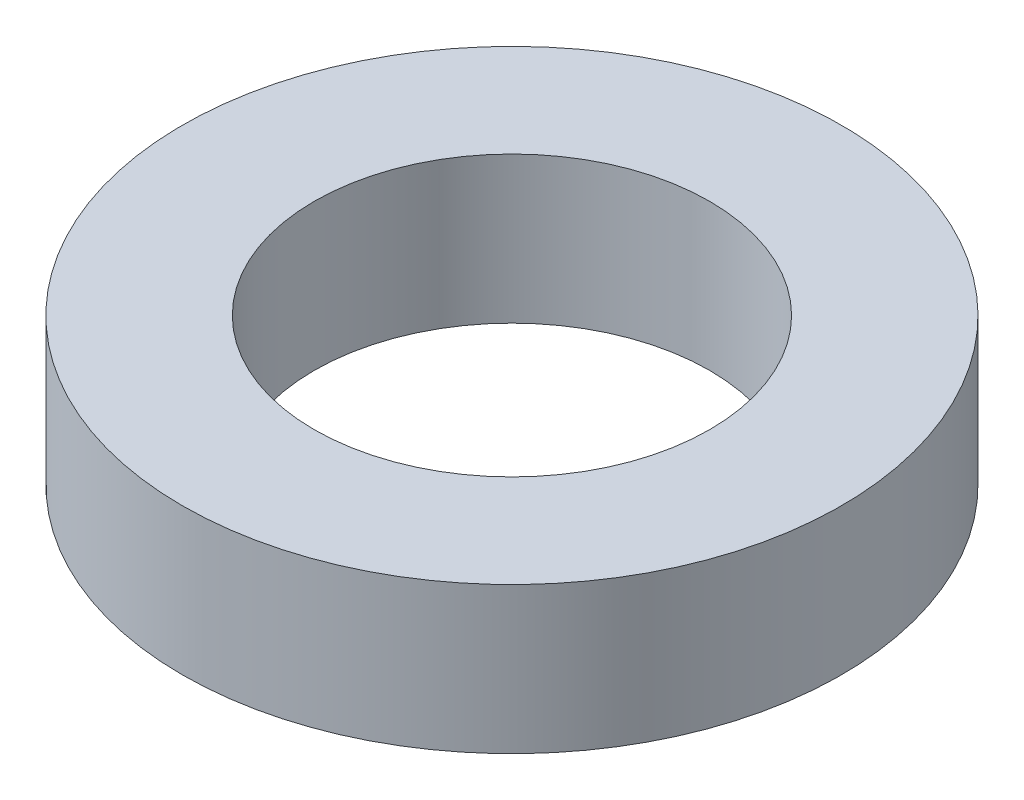
ISO-10303-21;
HEADER;
FILE_DESCRIPTION(('STEP AP214'),'2;1');
FILE_NAME('part.step','',(''),(''),'','','');
FILE_SCHEMA(('AUTOMOTIVE_DESIGN { 1 0 10303 214 1 1 1 1 }'));
ENDSEC;
DATA;
#1=APPLICATION_CONTEXT('core data for automotive mechanical design processes');
#2=APPLICATION_PROTOCOL_DEFINITION('international standard','automotive_design',2000,#1);
#3=PRODUCT_CONTEXT('',#1,'mechanical');
#4=PRODUCT('Part','Part','',(#3));
#5=PRODUCT_RELATED_PRODUCT_CATEGORY('part','',(#4));
#6=PRODUCT_DEFINITION_FORMATION('','',#4);
#7=PRODUCT_DEFINITION_CONTEXT('part definition',#1,'design');
#8=PRODUCT_DEFINITION('design','',#6,#7);
#9=PRODUCT_DEFINITION_SHAPE('','',#8);
#10=(LENGTH_UNIT() NAMED_UNIT(*) SI_UNIT(.MILLI.,.METRE.));
#11=(NAMED_UNIT(*) PLANE_ANGLE_UNIT() SI_UNIT($,.RADIAN.));
#12=(NAMED_UNIT(*) SI_UNIT($,.STERADIAN.) SOLID_ANGLE_UNIT());
#13=UNCERTAINTY_MEASURE_WITH_UNIT(LENGTH_MEASURE(1.E-05),#10,'distance_accuracy_value','');
#14=(GEOMETRIC_REPRESENTATION_CONTEXT(3) GLOBAL_UNCERTAINTY_ASSIGNED_CONTEXT((#13)) GLOBAL_UNIT_ASSIGNED_CONTEXT((#10,
#11,#12)) REPRESENTATION_CONTEXT('',''));
#15=CARTESIAN_POINT('',(0.,0.,0.));
#16=DIRECTION('',(0.,0.,1.));
#17=DIRECTION('',(1.,0.,0.));
#18=AXIS2_PLACEMENT_3D('',#15,#16,#17);
#19=CARTESIAN_POINT('',(0.,1.,0.));
#20=DIRECTION('',(0.,1.,0.));
#21=DIRECTION('',(0.,0.,1.));
#22=AXIS2_PLACEMENT_3D('',#19,#20,#21);
#23=PLANE('',#22);
#24=CARTESIAN_POINT('',(0.,1.,0.));
#25=DIRECTION('',(0.,1.,0.));
#26=DIRECTION('',(0.,0.,1.));
#27=AXIS2_PLACEMENT_3D('',#24,#25,#26);
#28=CIRCLE('',#27,4.5);
#29=CARTESIAN_POINT('',(0.,1.,4.5));
#30=VERTEX_POINT('',#29);
#31=EDGE_CURVE('E10',#30,#30,#28,.T.);
#32=ORIENTED_EDGE('',*,*,#31,.T.);
#33=EDGE_LOOP('',(#32));
#34=FACE_BOUND('',#33,.T.);
#35=CARTESIAN_POINT('',(0.,1.,0.));
#36=DIRECTION('',(0.,1.,0.));
#37=DIRECTION('',(0.,0.,1.));
#38=AXIS2_PLACEMENT_3D('',#35,#36,#37);
#39=CIRCLE('',#38,2.7);
#40=CARTESIAN_POINT('',(0.,1.,2.7));
#41=VERTEX_POINT('',#40);
#42=EDGE_CURVE('E47',#41,#41,#39,.T.);
#43=ORIENTED_EDGE('',*,*,#42,.F.);
#44=EDGE_LOOP('',(#43));
#45=FACE_BOUND('',#44,.T.);
#46=ADVANCED_FACE('F36',(#34,#45),#23,.T.);
#47=CARTESIAN_POINT('',(0.,-1.,0.));
#48=DIRECTION('',(0.,1.,0.));
#49=DIRECTION('',(0.,0.,1.));
#50=AXIS2_PLACEMENT_3D('',#47,#48,#49);
#51=PLANE('',#50);
#52=CARTESIAN_POINT('',(0.,-1.,0.));
#53=DIRECTION('',(0.,1.,0.));
#54=DIRECTION('',(0.,0.,1.));
#55=AXIS2_PLACEMENT_3D('',#52,#53,#54);
#56=CIRCLE('',#55,4.5);
#57=CARTESIAN_POINT('',(0.,-1.,4.5));
#58=VERTEX_POINT('',#57);
#59=EDGE_CURVE('E40',#58,#58,#56,.T.);
#60=ORIENTED_EDGE('',*,*,#59,.F.);
#61=EDGE_LOOP('',(#60));
#62=FACE_BOUND('',#61,.T.);
#63=CARTESIAN_POINT('',(0.,-1.,0.));
#64=DIRECTION('',(0.,1.,0.));
#65=DIRECTION('',(0.,0.,1.));
#66=AXIS2_PLACEMENT_3D('',#63,#64,#65);
#67=CIRCLE('',#66,2.7);
#68=CARTESIAN_POINT('',(0.,-1.,2.7));
#69=VERTEX_POINT('',#68);
#70=EDGE_CURVE('E49',#69,#69,#67,.T.);
#71=ORIENTED_EDGE('',*,*,#70,.T.);
#72=EDGE_LOOP('',(#71));
#73=FACE_BOUND('',#72,.T.);
#74=ADVANCED_FACE('F59',(#62,#73),#51,.F.);
#75=CARTESIAN_POINT('',(0.,1.,0.));
#76=DIRECTION('',(0.,-1.,0.));
#77=DIRECTION('',(0.,0.,-1.));
#78=AXIS2_PLACEMENT_3D('',#75,#76,#77);
#79=CYLINDRICAL_SURFACE('',#78,4.5);
#80=ORIENTED_EDGE('',*,*,#31,.F.);
#81=EDGE_LOOP('',(#80));
#82=FACE_BOUND('',#81,.T.);
#83=ORIENTED_EDGE('',*,*,#59,.T.);
#84=EDGE_LOOP('',(#83));
#85=FACE_BOUND('',#84,.T.);
#86=ADVANCED_FACE('F38',(#82,#85),#79,.T.);
#87=CARTESIAN_POINT('',(0.,1.,0.));
#88=DIRECTION('',(0.,-1.,0.));
#89=DIRECTION('',(0.,0.,-1.));
#90=AXIS2_PLACEMENT_3D('',#87,#88,#89);
#91=CYLINDRICAL_SURFACE('',#90,2.7);
#92=ORIENTED_EDGE('',*,*,#42,.T.);
#93=EDGE_LOOP('',(#92));
#94=FACE_BOUND('',#93,.T.);
#95=ORIENTED_EDGE('',*,*,#70,.F.);
#96=EDGE_LOOP('',(#95));
#97=FACE_BOUND('',#96,.T.);
#98=ADVANCED_FACE('F55',(#94,#97),#91,.F.);
#99=CLOSED_SHELL('',(#46,#74,#86,#98));
#100=MANIFOLD_SOLID_BREP('B2',#99);
#101=ADVANCED_BREP_SHAPE_REPRESENTATION('',(#18,#100),#14);
#102=SHAPE_DEFINITION_REPRESENTATION(#9,#101);
ENDSEC;
END-ISO-10303-21;
